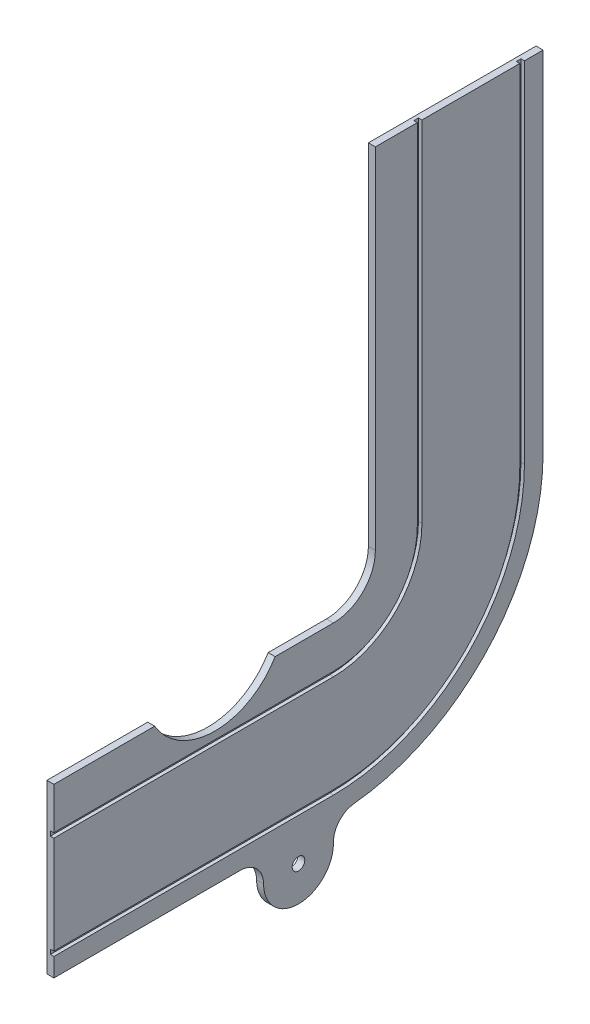
ISO-10303-21;
HEADER;
FILE_DESCRIPTION(('STEP AP214'),'2;1');
FILE_NAME('part.step','',(''),(''),'','','');
FILE_SCHEMA(('AUTOMOTIVE_DESIGN { 1 0 10303 214 1 1 1 1 }'));
ENDSEC;
DATA;
#1=APPLICATION_CONTEXT('core data for automotive mechanical design processes');
#2=APPLICATION_PROTOCOL_DEFINITION('international standard','automotive_design',2000,#1);
#3=PRODUCT_CONTEXT('',#1,'mechanical');
#4=PRODUCT('Part','Part','',(#3));
#5=PRODUCT_RELATED_PRODUCT_CATEGORY('part','',(#4));
#6=PRODUCT_DEFINITION_FORMATION('','',#4);
#7=PRODUCT_DEFINITION_CONTEXT('part definition',#1,'design');
#8=PRODUCT_DEFINITION('design','',#6,#7);
#9=PRODUCT_DEFINITION_SHAPE('','',#8);
#10=(LENGTH_UNIT() NAMED_UNIT(*) SI_UNIT(.MILLI.,.METRE.));
#11=(NAMED_UNIT(*) PLANE_ANGLE_UNIT() SI_UNIT($,.RADIAN.));
#12=(NAMED_UNIT(*) SI_UNIT($,.STERADIAN.) SOLID_ANGLE_UNIT());
#13=UNCERTAINTY_MEASURE_WITH_UNIT(LENGTH_MEASURE(1.E-05),#10,'distance_accuracy_value','');
#14=(GEOMETRIC_REPRESENTATION_CONTEXT(3) GLOBAL_UNCERTAINTY_ASSIGNED_CONTEXT((#13)) GLOBAL_UNIT_ASSIGNED_CONTEXT((#10,
#11,#12)) REPRESENTATION_CONTEXT('',''));
#15=CARTESIAN_POINT('',(0.,0.,0.));
#16=DIRECTION('',(0.,0.,1.));
#17=DIRECTION('',(1.,0.,0.));
#18=AXIS2_PLACEMENT_3D('',#15,#16,#17);
#19=CARTESIAN_POINT('',(3.,-18.,0.));
#20=DIRECTION('',(0.,-1.,0.));
#21=DIRECTION('',(0.,0.,-1.));
#22=AXIS2_PLACEMENT_3D('',#19,#20,#21);
#23=PLANE('',#22);
#24=DIRECTION('',(0.,0.,1.));
#25=VECTOR('',#24,1.);
#26=CARTESIAN_POINT('',(0.,-18.,0.));
#27=LINE('',#26,#25);
#28=CARTESIAN_POINT('',(0.,-18.,0.));
#29=VERTEX_POINT('',#28);
#30=CARTESIAN_POINT('',(0.,-18.,25.0330991311867));
#31=VERTEX_POINT('',#30);
#32=EDGE_CURVE('E248',#29,#31,#27,.T.);
#33=ORIENTED_EDGE('',*,*,#32,.T.);
#34=DIRECTION('',(1.,0.,0.));
#35=VECTOR('',#34,1.);
#36=CARTESIAN_POINT('',(0.,-18.,25.0330991311867));
#37=LINE('',#36,#35);
#38=CARTESIAN_POINT('',(3.,-18.,25.0330991311867));
#39=VERTEX_POINT('',#38);
#40=EDGE_CURVE('E49',#31,#39,#37,.T.);
#41=ORIENTED_EDGE('',*,*,#40,.T.);
#42=DIRECTION('',(0.,0.,1.));
#43=VECTOR('',#42,1.);
#44=CARTESIAN_POINT('',(3.,-18.,0.));
#45=LINE('',#44,#43);
#46=CARTESIAN_POINT('',(3.,-18.,0.));
#47=VERTEX_POINT('',#46);
#48=EDGE_CURVE('E446',#47,#39,#45,.T.);
#49=ORIENTED_EDGE('',*,*,#48,.F.);
#50=DIRECTION('',(-1.,0.,0.));
#51=VECTOR('',#50,1.);
#52=CARTESIAN_POINT('',(3.,-18.,0.));
#53=LINE('',#52,#51);
#54=EDGE_CURVE('E286',#47,#29,#53,.T.);
#55=ORIENTED_EDGE('',*,*,#54,.T.);
#56=EDGE_LOOP('',(#33,#41,#49,#55));
#57=FACE_BOUND('',#56,.T.);
#58=ADVANCED_FACE('F34',(#57),#23,.F.);
#59=CARTESIAN_POINT('',(3.,-90.,120.));
#60=DIRECTION('',(0.,1.,0.));
#61=DIRECTION('',(0.,0.,1.));
#62=AXIS2_PLACEMENT_3D('',#59,#60,#61);
#63=PLANE('',#62);
#64=DIRECTION('',(0.,0.,-1.));
#65=VECTOR('',#64,1.);
#66=CARTESIAN_POINT('',(0.,-90.,120.));
#67=LINE('',#66,#65);
#68=CARTESIAN_POINT('',(0.,-90.,120.));
#69=VERTEX_POINT('',#68);
#70=CARTESIAN_POINT('',(0.,-90.,40.));
#71=VERTEX_POINT('',#70);
#72=EDGE_CURVE('E257',#69,#71,#67,.T.);
#73=ORIENTED_EDGE('',*,*,#72,.T.);
#74=DIRECTION('',(1.,0.,0.));
#75=VECTOR('',#74,1.);
#76=CARTESIAN_POINT('',(3.,-90.,40.));
#77=LINE('',#76,#75);
#78=CARTESIAN_POINT('',(3.,-90.,40.));
#79=VERTEX_POINT('',#78);
#80=EDGE_CURVE('E294',#71,#79,#77,.T.);
#81=ORIENTED_EDGE('',*,*,#80,.T.);
#82=DIRECTION('',(0.,0.,-1.));
#83=VECTOR('',#82,1.);
#84=CARTESIAN_POINT('',(3.,-90.,120.));
#85=LINE('',#84,#83);
#86=CARTESIAN_POINT('',(3.,-90.,120.));
#87=VERTEX_POINT('',#86);
#88=EDGE_CURVE('E309',#87,#79,#85,.T.);
#89=ORIENTED_EDGE('',*,*,#88,.F.);
#90=DIRECTION('',(-1.,0.,0.));
#91=VECTOR('',#90,1.);
#92=CARTESIAN_POINT('',(3.,-90.,120.));
#93=LINE('',#92,#91);
#94=EDGE_CURVE('E281',#87,#69,#93,.T.);
#95=ORIENTED_EDGE('',*,*,#94,.T.);
#96=EDGE_LOOP('',(#73,#81,#89,#95));
#97=FACE_BOUND('',#96,.T.);
#98=ADVANCED_FACE('F575',(#97),#63,.F.);
#99=CARTESIAN_POINT('',(3.,0.,0.));
#100=DIRECTION('',(1.,0.,0.));
#101=DIRECTION('',(0.,0.,-1.));
#102=AXIS2_PLACEMENT_3D('',#99,#100,#101);
#103=PLANE('',#102);
#104=CARTESIAN_POINT('',(3.,-100.,15.));
#105=DIRECTION('',(1.,0.,0.));
#106=DIRECTION('',(0.,0.,-1.));
#107=AXIS2_PLACEMENT_3D('',#104,#105,#106);
#108=CIRCLE('',#107,2.7);
#109=CARTESIAN_POINT('',(3.,-100.,12.3));
#110=VERTEX_POINT('',#109);
#111=EDGE_CURVE('E482',#110,#110,#108,.T.);
#112=ORIENTED_EDGE('',*,*,#111,.F.);
#113=EDGE_LOOP('',(#112));
#114=FACE_BOUND('',#113,.T.);
#115=DIRECTION('',(0.,1.,0.));
#116=VECTOR('',#115,1.);
#117=CARTESIAN_POINT('',(3.,0.,-82.));
#118=LINE('',#117,#116);
#119=CARTESIAN_POINT('',(3.,0.,-82.));
#120=VERTEX_POINT('',#119);
#121=CARTESIAN_POINT('',(3.,150.,-82.));
#122=VERTEX_POINT('',#121);
#123=EDGE_CURVE('E365',#120,#122,#118,.T.);
#124=ORIENTED_EDGE('',*,*,#123,.F.);
#125=CARTESIAN_POINT('',(3.,0.,0.));
#126=DIRECTION('',(1.,0.,0.));
#127=DIRECTION('',(0.,0.,-1.));
#128=AXIS2_PLACEMENT_3D('',#125,#126,#127);
#129=CIRCLE('',#128,82.);
#130=CARTESIAN_POINT('',(3.,-82.,0.));
#131=VERTEX_POINT('',#130);
#132=EDGE_CURVE('E362',#131,#120,#129,.T.);
#133=ORIENTED_EDGE('',*,*,#132,.F.);
#134=DIRECTION('',(0.,0.,-1.));
#135=VECTOR('',#134,1.);
#136=CARTESIAN_POINT('',(3.,-82.,0.));
#137=LINE('',#136,#135);
#138=CARTESIAN_POINT('',(3.,-82.,120.));
#139=VERTEX_POINT('',#138);
#140=EDGE_CURVE('E359',#139,#131,#137,.T.);
#141=ORIENTED_EDGE('',*,*,#140,.F.);
#142=DIRECTION('',(0.,-1.,0.));
#143=VECTOR('',#142,1.);
#144=CARTESIAN_POINT('',(3.,-18.,120.));
#145=LINE('',#144,#143);
#146=EDGE_CURVE('E449',#139,#87,#145,.T.);
#147=ORIENTED_EDGE('',*,*,#146,.T.);
#148=ORIENTED_EDGE('',*,*,#88,.T.);
#149=CARTESIAN_POINT('',(3.,-100.,40.));
#150=DIRECTION('',(1.,0.,0.));
#151=DIRECTION('',(0.,0.,-1.));
#152=AXIS2_PLACEMENT_3D('',#149,#150,#151);
#153=CIRCLE('',#152,10.);
#154=CARTESIAN_POINT('',(3.,-100.,30.));
#155=VERTEX_POINT('',#154);
#156=EDGE_CURVE('E42',#79,#155,#153,.F.);
#157=ORIENTED_EDGE('',*,*,#156,.T.);
#158=CARTESIAN_POINT('',(3.,-100.,15.));
#159=DIRECTION('',(1.,0.,0.));
#160=DIRECTION('',(0.,0.,-1.));
#161=AXIS2_PLACEMENT_3D('',#158,#159,#160);
#162=CIRCLE('',#161,15.);
#163=CARTESIAN_POINT('',(3.,-100.,0.));
#164=VERTEX_POINT('',#163);
#165=EDGE_CURVE('E307',#155,#164,#162,.T.);
#166=ORIENTED_EDGE('',*,*,#165,.T.);
#167=DIRECTION('',(0.,1.,0.));
#168=VECTOR('',#167,1.);
#169=CARTESIAN_POINT('',(3.,0.,0.));
#170=LINE('',#169,#168);
#171=CARTESIAN_POINT('',(3.,-99.498743710662,0.));
#172=VERTEX_POINT('',#171);
#173=EDGE_CURVE('E319',#164,#172,#170,.T.);
#174=ORIENTED_EDGE('',*,*,#173,.T.);
#175=CARTESIAN_POINT('',(3.,-99.498743710662,-10.));
#176=DIRECTION('',(1.,0.,0.));
#177=DIRECTION('',(0.,0.,-1.));
#178=AXIS2_PLACEMENT_3D('',#175,#176,#177);
#179=CIRCLE('',#178,10.);
#180=CARTESIAN_POINT('',(3.,-89.5488693395958,-9.00000000000001));
#181=VERTEX_POINT('',#180);
#182=EDGE_CURVE('E299',#172,#181,#179,.F.);
#183=ORIENTED_EDGE('',*,*,#182,.T.);
#184=CARTESIAN_POINT('',(3.,0.,0.));
#185=DIRECTION('',(1.,0.,0.));
#186=DIRECTION('',(0.,0.,-1.));
#187=AXIS2_PLACEMENT_3D('',#184,#185,#186);
#188=CIRCLE('',#187,90.);
#189=CARTESIAN_POINT('',(3.,0.,-90.));
#190=VERTEX_POINT('',#189);
#191=EDGE_CURVE('E455',#181,#190,#188,.T.);
#192=ORIENTED_EDGE('',*,*,#191,.T.);
#193=DIRECTION('',(0.,1.,0.));
#194=VECTOR('',#193,1.);
#195=CARTESIAN_POINT('',(3.,150.,-90.));
#196=LINE('',#195,#194);
#197=CARTESIAN_POINT('',(3.,150.,-90.));
#198=VERTEX_POINT('',#197);
#199=EDGE_CURVE('E457',#190,#198,#196,.T.);
#200=ORIENTED_EDGE('',*,*,#199,.T.);
#201=DIRECTION('',(0.,0.,1.));
#202=VECTOR('',#201,1.);
#203=CARTESIAN_POINT('',(3.,150.,-18.));
#204=LINE('',#203,#202);
#205=EDGE_CURVE('E460',#198,#122,#204,.T.);
#206=ORIENTED_EDGE('',*,*,#205,.T.);
#207=EDGE_LOOP('',(#124,#133,#141,#147,#148,#157,#166,#174,#183,#192,#200,#206));
#208=FACE_BOUND('',#207,.T.);
#209=ADVANCED_FACE('F305',(#114,#208),#103,.T.);
#210=CARTESIAN_POINT('',(3.,-2.77203653632514,50.8809061706433));
#211=DIRECTION('',(1.,0.,0.));
#212=DIRECTION('',(0.,0.,-1.));
#213=AXIS2_PLACEMENT_3D('',#210,#211,#212);
#214=CIRCLE('',#213,30.);
#215=CARTESIAN_POINT('',(3.,-18.,76.7287132101));
#216=VERTEX_POINT('',#215);
#217=EDGE_CURVE('E235',#216,#39,#214,.T.);
#218=ORIENTED_EDGE('',*,*,#217,.F.);
#219=CARTESIAN_POINT('',(3.,-18.,120.));
#220=VERTEX_POINT('',#219);
#221=EDGE_CURVE('E243',#216,#220,#45,.T.);
#222=ORIENTED_EDGE('',*,*,#221,.T.);
#223=CARTESIAN_POINT('',(3.,-36.,120.));
#224=VERTEX_POINT('',#223);
#225=EDGE_CURVE('E450',#220,#224,#145,.T.);
#226=ORIENTED_EDGE('',*,*,#225,.T.);
#227=DIRECTION('',(0.,0.,1.));
#228=VECTOR('',#227,1.);
#229=CARTESIAN_POINT('',(3.,-36.,0.));
#230=LINE('',#229,#228);
#231=CARTESIAN_POINT('',(3.,-36.,0.));
#232=VERTEX_POINT('',#231);
#233=EDGE_CURVE('E423',#232,#224,#230,.T.);
#234=ORIENTED_EDGE('',*,*,#233,.F.);
#235=CARTESIAN_POINT('',(3.,0.,0.));
#236=DIRECTION('',(-1.,0.,0.));
#237=DIRECTION('',(0.,0.,-1.));
#238=AXIS2_PLACEMENT_3D('',#235,#236,#237);
#239=CIRCLE('',#238,36.);
#240=CARTESIAN_POINT('',(3.,0.,-36.));
#241=VERTEX_POINT('',#240);
#242=EDGE_CURVE('E420',#241,#232,#239,.T.);
#243=ORIENTED_EDGE('',*,*,#242,.F.);
#244=DIRECTION('',(0.,-1.,0.));
#245=VECTOR('',#244,1.);
#246=CARTESIAN_POINT('',(3.,0.,-36.));
#247=LINE('',#246,#245);
#248=CARTESIAN_POINT('',(3.,150.,-36.));
#249=VERTEX_POINT('',#248);
#250=EDGE_CURVE('E417',#249,#241,#247,.T.);
#251=ORIENTED_EDGE('',*,*,#250,.F.);
#252=CARTESIAN_POINT('',(3.,150.,-18.));
#253=VERTEX_POINT('',#252);
#254=EDGE_CURVE('E459',#249,#253,#204,.T.);
#255=ORIENTED_EDGE('',*,*,#254,.T.);
#256=DIRECTION('',(0.,-1.,0.));
#257=VECTOR('',#256,1.);
#258=CARTESIAN_POINT('',(3.,0.,-18.));
#259=LINE('',#258,#257);
#260=CARTESIAN_POINT('',(3.,0.,-18.));
#261=VERTEX_POINT('',#260);
#262=EDGE_CURVE('E272',#253,#261,#259,.T.);
#263=ORIENTED_EDGE('',*,*,#262,.T.);
#264=CARTESIAN_POINT('',(3.,0.,0.));
#265=DIRECTION('',(-1.,0.,0.));
#266=DIRECTION('',(0.,0.,-1.));
#267=AXIS2_PLACEMENT_3D('',#264,#265,#266);
#268=CIRCLE('',#267,18.);
#269=EDGE_CURVE('E267',#261,#47,#268,.T.);
#270=ORIENTED_EDGE('',*,*,#269,.T.);
#271=ORIENTED_EDGE('',*,*,#48,.T.);
#272=EDGE_LOOP('',(#218,#222,#226,#234,#243,#251,#255,#263,#270,#271));
#273=FACE_BOUND('',#272,.T.);
#274=ADVANCED_FACE('F466',(#273),#103,.T.);
#275=CARTESIAN_POINT('',(3.,0.,0.));
#276=DIRECTION('',(-1.,0.,0.));
#277=DIRECTION('',(0.,0.,1.));
#278=AXIS2_PLACEMENT_3D('',#275,#276,#277);
#279=CYLINDRICAL_SURFACE('',#278,18.);
#280=CARTESIAN_POINT('',(0.,0.,0.));
#281=DIRECTION('',(-1.,0.,0.));
#282=DIRECTION('',(0.,0.,-1.));
#283=AXIS2_PLACEMENT_3D('',#280,#281,#282);
#284=CIRCLE('',#283,18.);
#285=CARTESIAN_POINT('',(0.,0.,-18.));
#286=VERTEX_POINT('',#285);
#287=EDGE_CURVE('E249',#286,#29,#284,.T.);
#288=ORIENTED_EDGE('',*,*,#287,.T.);
#289=ORIENTED_EDGE('',*,*,#54,.F.);
#290=ORIENTED_EDGE('',*,*,#269,.F.);
#291=DIRECTION('',(-1.,0.,0.));
#292=VECTOR('',#291,1.);
#293=CARTESIAN_POINT('',(3.,0.,-18.));
#294=LINE('',#293,#292);
#295=EDGE_CURVE('E268',#261,#286,#294,.T.);
#296=ORIENTED_EDGE('',*,*,#295,.T.);
#297=EDGE_LOOP('',(#288,#289,#290,#296));
#298=FACE_BOUND('',#297,.T.);
#299=ADVANCED_FACE('F477',(#298),#279,.F.);
#300=ORIENTED_EDGE('',*,*,#221,.F.);
#301=DIRECTION('',(1.,0.,0.));
#302=VECTOR('',#301,1.);
#303=CARTESIAN_POINT('',(0.,-18.,76.7287132101));
#304=LINE('',#303,#302);
#305=CARTESIAN_POINT('',(0.,-18.,76.7287132101));
#306=VERTEX_POINT('',#305);
#307=EDGE_CURVE('E231',#216,#306,#304,.F.);
#308=ORIENTED_EDGE('',*,*,#307,.T.);
#309=CARTESIAN_POINT('',(0.,-18.,120.));
#310=VERTEX_POINT('',#309);
#311=EDGE_CURVE('E241',#306,#310,#27,.T.);
#312=ORIENTED_EDGE('',*,*,#311,.T.);
#313=DIRECTION('',(-1.,0.,0.));
#314=VECTOR('',#313,1.);
#315=CARTESIAN_POINT('',(3.,-18.,120.));
#316=LINE('',#315,#314);
#317=EDGE_CURVE('E284',#220,#310,#316,.T.);
#318=ORIENTED_EDGE('',*,*,#317,.F.);
#319=EDGE_LOOP('',(#300,#308,#312,#318));
#320=FACE_BOUND('',#319,.T.);
#321=ADVANCED_FACE('F239',(#320),#23,.F.);
#322=CARTESIAN_POINT('',(3.,-18.,120.));
#323=DIRECTION('',(0.,0.,-1.));
#324=DIRECTION('',(0.,1.,0.));
#325=AXIS2_PLACEMENT_3D('',#322,#323,#324);
#326=PLANE('',#325);
#327=ORIENTED_EDGE('',*,*,#146,.F.);
#328=DIRECTION('',(1.,0.,0.));
#329=VECTOR('',#328,1.);
#330=CARTESIAN_POINT('',(1.5,-82.,120.));
#331=LINE('',#330,#329);
#332=CARTESIAN_POINT('',(1.5,-82.,120.));
#333=VERTEX_POINT('',#332);
#334=EDGE_CURVE('E381',#333,#139,#331,.T.);
#335=ORIENTED_EDGE('',*,*,#334,.F.);
#336=DIRECTION('',(0.,-1.,0.));
#337=VECTOR('',#336,1.);
#338=CARTESIAN_POINT('',(1.5,-80.,120.));
#339=LINE('',#338,#337);
#340=CARTESIAN_POINT('',(1.5,-80.,120.));
#341=VERTEX_POINT('',#340);
#342=EDGE_CURVE('E338',#341,#333,#339,.T.);
#343=ORIENTED_EDGE('',*,*,#342,.F.);
#344=DIRECTION('',(1.,0.,0.));
#345=VECTOR('',#344,1.);
#346=CARTESIAN_POINT('',(1.5,-80.,120.));
#347=LINE('',#346,#345);
#348=CARTESIAN_POINT('',(3.,-80.,120.));
#349=VERTEX_POINT('',#348);
#350=EDGE_CURVE('E383',#341,#349,#347,.T.);
#351=ORIENTED_EDGE('',*,*,#350,.T.);
#352=CARTESIAN_POINT('',(3.,-38.,120.));
#353=VERTEX_POINT('',#352);
#354=EDGE_CURVE('E453',#353,#349,#145,.T.);
#355=ORIENTED_EDGE('',*,*,#354,.F.);
#356=DIRECTION('',(1.,0.,0.));
#357=VECTOR('',#356,1.);
#358=CARTESIAN_POINT('',(1.5,-38.,120.));
#359=LINE('',#358,#357);
#360=CARTESIAN_POINT('',(1.5,-38.,120.));
#361=VERTEX_POINT('',#360);
#362=EDGE_CURVE('E428',#361,#353,#359,.T.);
#363=ORIENTED_EDGE('',*,*,#362,.F.);
#364=DIRECTION('',(0.,-1.,0.));
#365=VECTOR('',#364,1.);
#366=CARTESIAN_POINT('',(1.5,-36.,120.));
#367=LINE('',#366,#365);
#368=CARTESIAN_POINT('',(1.5,-36.,120.));
#369=VERTEX_POINT('',#368);
#370=EDGE_CURVE('E407',#369,#361,#367,.T.);
#371=ORIENTED_EDGE('',*,*,#370,.F.);
#372=DIRECTION('',(1.,0.,0.));
#373=VECTOR('',#372,1.);
#374=CARTESIAN_POINT('',(1.5,-36.,120.));
#375=LINE('',#374,#373);
#376=EDGE_CURVE('E430',#369,#224,#375,.T.);
#377=ORIENTED_EDGE('',*,*,#376,.T.);
#378=ORIENTED_EDGE('',*,*,#225,.F.);
#379=ORIENTED_EDGE('',*,*,#317,.T.);
#380=DIRECTION('',(0.,-1.,0.));
#381=VECTOR('',#380,1.);
#382=CARTESIAN_POINT('',(0.,-18.,120.));
#383=LINE('',#382,#381);
#384=EDGE_CURVE('E247',#310,#69,#383,.T.);
#385=ORIENTED_EDGE('',*,*,#384,.T.);
#386=ORIENTED_EDGE('',*,*,#94,.F.);
#387=EDGE_LOOP('',(#327,#335,#343,#351,#355,#363,#371,#377,#378,#379,#385,#386));
#388=FACE_BOUND('',#387,.T.);
#389=ADVANCED_FACE('F524',(#388),#326,.F.);
#390=CARTESIAN_POINT('',(3.,0.,0.));
#391=DIRECTION('',(-1.,0.,0.));
#392=DIRECTION('',(0.,0.,1.));
#393=AXIS2_PLACEMENT_3D('',#390,#391,#392);
#394=CYLINDRICAL_SURFACE('',#393,90.);
#395=ORIENTED_EDGE('',*,*,#191,.F.);
#396=DIRECTION('',(-1.,0.,0.));
#397=VECTOR('',#396,1.);
#398=CARTESIAN_POINT('',(3.,-89.5488693395958,-9.00000000000001));
#399=LINE('',#398,#397);
#400=CARTESIAN_POINT('',(0.,-89.5488693395958,-9.00000000000001));
#401=VERTEX_POINT('',#400);
#402=EDGE_CURVE('E289',#181,#401,#399,.T.);
#403=ORIENTED_EDGE('',*,*,#402,.T.);
#404=CARTESIAN_POINT('',(0.,0.,0.));
#405=DIRECTION('',(1.,0.,0.));
#406=DIRECTION('',(0.,0.,-1.));
#407=AXIS2_PLACEMENT_3D('',#404,#405,#406);
#408=CIRCLE('',#407,90.);
#409=CARTESIAN_POINT('',(0.,0.,-90.));
#410=VERTEX_POINT('',#409);
#411=EDGE_CURVE('E259',#401,#410,#408,.T.);
#412=ORIENTED_EDGE('',*,*,#411,.T.);
#413=DIRECTION('',(-1.,0.,0.));
#414=VECTOR('',#413,1.);
#415=CARTESIAN_POINT('',(3.,0.,-90.));
#416=LINE('',#415,#414);
#417=EDGE_CURVE('E278',#190,#410,#416,.T.);
#418=ORIENTED_EDGE('',*,*,#417,.F.);
#419=EDGE_LOOP('',(#395,#403,#412,#418));
#420=FACE_BOUND('',#419,.T.);
#421=ADVANCED_FACE('F496',(#420),#394,.T.);
#422=CARTESIAN_POINT('',(3.,150.,-90.));
#423=DIRECTION('',(0.,0.,1.));
#424=DIRECTION('',(0.,-1.,0.));
#425=AXIS2_PLACEMENT_3D('',#422,#423,#424);
#426=PLANE('',#425);
#427=DIRECTION('',(0.,1.,0.));
#428=VECTOR('',#427,1.);
#429=CARTESIAN_POINT('',(0.,150.,-90.));
#430=LINE('',#429,#428);
#431=CARTESIAN_POINT('',(0.,150.,-90.));
#432=VERTEX_POINT('',#431);
#433=EDGE_CURVE('E261',#410,#432,#430,.T.);
#434=ORIENTED_EDGE('',*,*,#433,.T.);
#435=DIRECTION('',(-1.,0.,0.));
#436=VECTOR('',#435,1.);
#437=CARTESIAN_POINT('',(3.,150.,-90.));
#438=LINE('',#437,#436);
#439=EDGE_CURVE('E275',#198,#432,#438,.T.);
#440=ORIENTED_EDGE('',*,*,#439,.F.);
#441=ORIENTED_EDGE('',*,*,#199,.F.);
#442=ORIENTED_EDGE('',*,*,#417,.T.);
#443=EDGE_LOOP('',(#434,#440,#441,#442));
#444=FACE_BOUND('',#443,.T.);
#445=ADVANCED_FACE('F503',(#444),#426,.F.);
#446=CARTESIAN_POINT('',(3.,150.,-18.));
#447=DIRECTION('',(0.,-1.,0.));
#448=DIRECTION('',(0.,0.,-1.));
#449=AXIS2_PLACEMENT_3D('',#446,#447,#448);
#450=PLANE('',#449);
#451=CARTESIAN_POINT('',(3.,150.,-80.));
#452=VERTEX_POINT('',#451);
#453=CARTESIAN_POINT('',(3.,150.,-38.));
#454=VERTEX_POINT('',#453);
#455=EDGE_CURVE('E462',#452,#454,#204,.T.);
#456=ORIENTED_EDGE('',*,*,#455,.F.);
#457=DIRECTION('',(1.,0.,0.));
#458=VECTOR('',#457,1.);
#459=CARTESIAN_POINT('',(1.5,150.,-80.));
#460=LINE('',#459,#458);
#461=CARTESIAN_POINT('',(1.5,150.,-80.));
#462=VERTEX_POINT('',#461);
#463=EDGE_CURVE('E372',#462,#452,#460,.T.);
#464=ORIENTED_EDGE('',*,*,#463,.F.);
#465=DIRECTION('',(0.,0.,1.));
#466=VECTOR('',#465,1.);
#467=CARTESIAN_POINT('',(1.5,150.,-80.));
#468=LINE('',#467,#466);
#469=CARTESIAN_POINT('',(1.5,150.,-82.));
#470=VERTEX_POINT('',#469);
#471=EDGE_CURVE('E350',#470,#462,#468,.T.);
#472=ORIENTED_EDGE('',*,*,#471,.F.);
#473=DIRECTION('',(1.,0.,0.));
#474=VECTOR('',#473,1.);
#475=CARTESIAN_POINT('',(1.5,150.,-82.));
#476=LINE('',#475,#474);
#477=EDGE_CURVE('E374',#470,#122,#476,.T.);
#478=ORIENTED_EDGE('',*,*,#477,.T.);
#479=ORIENTED_EDGE('',*,*,#205,.F.);
#480=ORIENTED_EDGE('',*,*,#439,.T.);
#481=DIRECTION('',(0.,0.,1.));
#482=VECTOR('',#481,1.);
#483=CARTESIAN_POINT('',(0.,150.,-18.));
#484=LINE('',#483,#482);
#485=CARTESIAN_POINT('',(0.,150.,-18.));
#486=VERTEX_POINT('',#485);
#487=EDGE_CURVE('E263',#432,#486,#484,.T.);
#488=ORIENTED_EDGE('',*,*,#487,.T.);
#489=DIRECTION('',(-1.,0.,0.));
#490=VECTOR('',#489,1.);
#491=CARTESIAN_POINT('',(3.,150.,-18.));
#492=LINE('',#491,#490);
#493=EDGE_CURVE('E271',#253,#486,#492,.T.);
#494=ORIENTED_EDGE('',*,*,#493,.F.);
#495=ORIENTED_EDGE('',*,*,#254,.F.);
#496=DIRECTION('',(1.,0.,0.));
#497=VECTOR('',#496,1.);
#498=CARTESIAN_POINT('',(1.5,150.,-36.));
#499=LINE('',#498,#497);
#500=CARTESIAN_POINT('',(1.5,150.,-36.));
#501=VERTEX_POINT('',#500);
#502=EDGE_CURVE('E437',#501,#249,#499,.T.);
#503=ORIENTED_EDGE('',*,*,#502,.F.);
#504=DIRECTION('',(0.,0.,1.));
#505=VECTOR('',#504,1.);
#506=CARTESIAN_POINT('',(1.5,150.,-36.));
#507=LINE('',#506,#505);
#508=CARTESIAN_POINT('',(1.5,150.,-38.));
#509=VERTEX_POINT('',#508);
#510=EDGE_CURVE('E395',#509,#501,#507,.T.);
#511=ORIENTED_EDGE('',*,*,#510,.F.);
#512=DIRECTION('',(1.,0.,0.));
#513=VECTOR('',#512,1.);
#514=CARTESIAN_POINT('',(1.5,150.,-38.));
#515=LINE('',#514,#513);
#516=EDGE_CURVE('E439',#509,#454,#515,.T.);
#517=ORIENTED_EDGE('',*,*,#516,.T.);
#518=EDGE_LOOP('',(#456,#464,#472,#478,#479,#480,#488,#494,#495,#503,#511,#517));
#519=FACE_BOUND('',#518,.T.);
#520=ADVANCED_FACE('F508',(#519),#450,.F.);
#521=CARTESIAN_POINT('',(3.,0.,-18.));
#522=DIRECTION('',(0.,0.,-1.));
#523=DIRECTION('',(-1.,0.,0.));
#524=AXIS2_PLACEMENT_3D('',#521,#522,#523);
#525=PLANE('',#524);
#526=DIRECTION('',(0.,-1.,0.));
#527=VECTOR('',#526,1.);
#528=CARTESIAN_POINT('',(0.,0.,-18.));
#529=LINE('',#528,#527);
#530=EDGE_CURVE('E265',#486,#286,#529,.T.);
#531=ORIENTED_EDGE('',*,*,#530,.T.);
#532=ORIENTED_EDGE('',*,*,#295,.F.);
#533=ORIENTED_EDGE('',*,*,#262,.F.);
#534=ORIENTED_EDGE('',*,*,#493,.T.);
#535=EDGE_LOOP('',(#531,#532,#533,#534));
#536=FACE_BOUND('',#535,.T.);
#537=ADVANCED_FACE('F473',(#536),#525,.F.);
#538=DIRECTION('',(0.,-1.,0.));
#539=VECTOR('',#538,1.);
#540=CARTESIAN_POINT('',(3.,0.,-80.));
#541=LINE('',#540,#539);
#542=CARTESIAN_POINT('',(3.,0.,-80.));
#543=VERTEX_POINT('',#542);
#544=EDGE_CURVE('E335',#452,#543,#541,.T.);
#545=ORIENTED_EDGE('',*,*,#544,.F.);
#546=ORIENTED_EDGE('',*,*,#455,.T.);
#547=DIRECTION('',(0.,1.,0.));
#548=VECTOR('',#547,1.);
#549=CARTESIAN_POINT('',(3.,0.,-38.));
#550=LINE('',#549,#548);
#551=CARTESIAN_POINT('',(3.,0.,-38.));
#552=VERTEX_POINT('',#551);
#553=EDGE_CURVE('E414',#552,#454,#550,.T.);
#554=ORIENTED_EDGE('',*,*,#553,.F.);
#555=CARTESIAN_POINT('',(3.,0.,0.));
#556=DIRECTION('',(1.,0.,0.));
#557=DIRECTION('',(0.,0.,-1.));
#558=AXIS2_PLACEMENT_3D('',#555,#556,#557);
#559=CIRCLE('',#558,38.);
#560=CARTESIAN_POINT('',(3.,-38.,0.));
#561=VERTEX_POINT('',#560);
#562=EDGE_CURVE('E371',#561,#552,#559,.T.);
#563=ORIENTED_EDGE('',*,*,#562,.F.);
#564=DIRECTION('',(0.,0.,-1.));
#565=VECTOR('',#564,1.);
#566=CARTESIAN_POINT('',(3.,-38.,0.));
#567=LINE('',#566,#565);
#568=EDGE_CURVE('E392',#353,#561,#567,.T.);
#569=ORIENTED_EDGE('',*,*,#568,.F.);
#570=ORIENTED_EDGE('',*,*,#354,.T.);
#571=DIRECTION('',(0.,0.,1.));
#572=VECTOR('',#571,1.);
#573=CARTESIAN_POINT('',(3.,-80.,0.));
#574=LINE('',#573,#572);
#575=CARTESIAN_POINT('',(3.,-80.,0.));
#576=VERTEX_POINT('',#575);
#577=EDGE_CURVE('E357',#576,#349,#574,.T.);
#578=ORIENTED_EDGE('',*,*,#577,.F.);
#579=CARTESIAN_POINT('',(3.,0.,0.));
#580=DIRECTION('',(-1.,0.,0.));
#581=DIRECTION('',(0.,0.,-1.));
#582=AXIS2_PLACEMENT_3D('',#579,#580,#581);
#583=CIRCLE('',#582,80.);
#584=EDGE_CURVE('E324',#543,#576,#583,.T.);
#585=ORIENTED_EDGE('',*,*,#584,.F.);
#586=EDGE_LOOP('',(#545,#546,#554,#563,#569,#570,#578,#585));
#587=FACE_BOUND('',#586,.T.);
#588=ADVANCED_FACE('F532',(#587),#103,.T.);
#589=CARTESIAN_POINT('',(0.,0.,0.));
#590=DIRECTION('',(1.,0.,0.));
#591=DIRECTION('',(0.,0.,-1.));
#592=AXIS2_PLACEMENT_3D('',#589,#590,#591);
#593=PLANE('',#592);
#594=CARTESIAN_POINT('',(0.,-100.,15.));
#595=DIRECTION('',(1.,0.,0.));
#596=DIRECTION('',(0.,0.,-1.));
#597=AXIS2_PLACEMENT_3D('',#594,#595,#596);
#598=CIRCLE('',#597,2.7);
#599=CARTESIAN_POINT('',(0.,-100.,12.3));
#600=VERTEX_POINT('',#599);
#601=EDGE_CURVE('E320',#600,#600,#598,.T.);
#602=ORIENTED_EDGE('',*,*,#601,.T.);
#603=EDGE_LOOP('',(#602));
#604=FACE_BOUND('',#603,.T.);
#605=ORIENTED_EDGE('',*,*,#311,.F.);
#606=CARTESIAN_POINT('',(0.,-2.77203653632514,50.8809061706433));
#607=DIRECTION('',(1.,0.,0.));
#608=DIRECTION('',(0.,0.,-1.));
#609=AXIS2_PLACEMENT_3D('',#606,#607,#608);
#610=CIRCLE('',#609,30.);
#611=EDGE_CURVE('E228',#306,#31,#610,.T.);
#612=ORIENTED_EDGE('',*,*,#611,.T.);
#613=ORIENTED_EDGE('',*,*,#32,.F.);
#614=ORIENTED_EDGE('',*,*,#287,.F.);
#615=ORIENTED_EDGE('',*,*,#530,.F.);
#616=ORIENTED_EDGE('',*,*,#487,.F.);
#617=ORIENTED_EDGE('',*,*,#433,.F.);
#618=ORIENTED_EDGE('',*,*,#411,.F.);
#619=CARTESIAN_POINT('',(0.,-99.498743710662,-10.));
#620=DIRECTION('',(1.,0.,0.));
#621=DIRECTION('',(0.,0.,-1.));
#622=AXIS2_PLACEMENT_3D('',#619,#620,#621);
#623=CIRCLE('',#622,10.);
#624=CARTESIAN_POINT('',(0.,-99.498743710662,0.));
#625=VERTEX_POINT('',#624);
#626=EDGE_CURVE('E297',#401,#625,#623,.T.);
#627=ORIENTED_EDGE('',*,*,#626,.T.);
#628=DIRECTION('',(0.,1.,0.));
#629=VECTOR('',#628,1.);
#630=CARTESIAN_POINT('',(0.,0.,0.));
#631=LINE('',#630,#629);
#632=CARTESIAN_POINT('',(0.,-100.,0.));
#633=VERTEX_POINT('',#632);
#634=EDGE_CURVE('E322',#633,#625,#631,.T.);
#635=ORIENTED_EDGE('',*,*,#634,.F.);
#636=CARTESIAN_POINT('',(0.,-100.,15.));
#637=DIRECTION('',(1.,0.,0.));
#638=DIRECTION('',(0.,0.,-1.));
#639=AXIS2_PLACEMENT_3D('',#636,#637,#638);
#640=CIRCLE('',#639,15.);
#641=CARTESIAN_POINT('',(0.,-100.,30.));
#642=VERTEX_POINT('',#641);
#643=EDGE_CURVE('E327',#642,#633,#640,.T.);
#644=ORIENTED_EDGE('',*,*,#643,.F.);
#645=CARTESIAN_POINT('',(0.,-100.,40.));
#646=DIRECTION('',(1.,0.,0.));
#647=DIRECTION('',(0.,0.,-1.));
#648=AXIS2_PLACEMENT_3D('',#645,#646,#647);
#649=CIRCLE('',#648,10.);
#650=EDGE_CURVE('E11',#642,#71,#649,.T.);
#651=ORIENTED_EDGE('',*,*,#650,.T.);
#652=ORIENTED_EDGE('',*,*,#72,.F.);
#653=ORIENTED_EDGE('',*,*,#384,.F.);
#654=EDGE_LOOP('',(#605,#612,#613,#614,#615,#616,#617,#618,#627,#635,#644,#651,#652,#653));
#655=FACE_BOUND('',#654,.T.);
#656=ADVANCED_FACE('F246',(#604,#655),#593,.F.);
#657=CARTESIAN_POINT('',(1.5,0.,0.));
#658=DIRECTION('',(1.,0.,0.));
#659=DIRECTION('',(0.,0.,-1.));
#660=AXIS2_PLACEMENT_3D('',#657,#658,#659);
#661=CYLINDRICAL_SURFACE('',#660,38.);
#662=ORIENTED_EDGE('',*,*,#562,.T.);
#663=DIRECTION('',(1.,0.,0.));
#664=VECTOR('',#663,1.);
#665=CARTESIAN_POINT('',(1.5,0.,-38.));
#666=LINE('',#665,#664);
#667=CARTESIAN_POINT('',(1.5,0.,-38.));
#668=VERTEX_POINT('',#667);
#669=EDGE_CURVE('E412',#668,#552,#666,.T.);
#670=ORIENTED_EDGE('',*,*,#669,.F.);
#671=CARTESIAN_POINT('',(1.5,0.,0.));
#672=DIRECTION('',(1.,0.,0.));
#673=DIRECTION('',(0.,0.,-1.));
#674=AXIS2_PLACEMENT_3D('',#671,#672,#673);
#675=CIRCLE('',#674,38.);
#676=CARTESIAN_POINT('',(1.5,-38.,0.));
#677=VERTEX_POINT('',#676);
#678=EDGE_CURVE('E388',#677,#668,#675,.T.);
#679=ORIENTED_EDGE('',*,*,#678,.F.);
#680=DIRECTION('',(1.,0.,0.));
#681=VECTOR('',#680,1.);
#682=CARTESIAN_POINT('',(1.5,-38.,0.));
#683=LINE('',#682,#681);
#684=EDGE_CURVE('E252',#677,#561,#683,.T.);
#685=ORIENTED_EDGE('',*,*,#684,.T.);
#686=EDGE_LOOP('',(#662,#670,#679,#685));
#687=FACE_BOUND('',#686,.T.);
#688=ADVANCED_FACE('F559',(#687),#661,.F.);
#689=CARTESIAN_POINT('',(1.5,-38.,0.));
#690=DIRECTION('',(0.,-1.,0.));
#691=DIRECTION('',(0.,0.,-1.));
#692=AXIS2_PLACEMENT_3D('',#689,#690,#691);
#693=PLANE('',#692);
#694=ORIENTED_EDGE('',*,*,#568,.T.);
#695=ORIENTED_EDGE('',*,*,#684,.F.);
#696=DIRECTION('',(0.,0.,-1.));
#697=VECTOR('',#696,1.);
#698=CARTESIAN_POINT('',(1.5,-38.,0.));
#699=LINE('',#698,#697);
#700=EDGE_CURVE('E409',#361,#677,#699,.T.);
#701=ORIENTED_EDGE('',*,*,#700,.F.);
#702=ORIENTED_EDGE('',*,*,#362,.T.);
#703=EDGE_LOOP('',(#694,#695,#701,#702));
#704=FACE_BOUND('',#703,.T.);
#705=ADVANCED_FACE('F561',(#704),#693,.F.);
#706=CARTESIAN_POINT('',(1.5,-36.,0.));
#707=DIRECTION('',(0.,1.,0.));
#708=DIRECTION('',(0.,0.,1.));
#709=AXIS2_PLACEMENT_3D('',#706,#707,#708);
#710=PLANE('',#709);
#711=ORIENTED_EDGE('',*,*,#233,.T.);
#712=ORIENTED_EDGE('',*,*,#376,.F.);
#713=DIRECTION('',(0.,0.,1.));
#714=VECTOR('',#713,1.);
#715=CARTESIAN_POINT('',(1.5,-36.,0.));
#716=LINE('',#715,#714);
#717=CARTESIAN_POINT('',(1.5,-36.,0.));
#718=VERTEX_POINT('',#717);
#719=EDGE_CURVE('E404',#718,#369,#716,.T.);
#720=ORIENTED_EDGE('',*,*,#719,.F.);
#721=DIRECTION('',(1.,0.,0.));
#722=VECTOR('',#721,1.);
#723=CARTESIAN_POINT('',(1.5,-36.,0.));
#724=LINE('',#723,#722);
#725=EDGE_CURVE('E433',#718,#232,#724,.T.);
#726=ORIENTED_EDGE('',*,*,#725,.T.);
#727=EDGE_LOOP('',(#711,#712,#720,#726));
#728=FACE_BOUND('',#727,.T.);
#729=ADVANCED_FACE('F563',(#728),#710,.F.);
#730=CARTESIAN_POINT('',(1.5,0.,0.));
#731=DIRECTION('',(1.,0.,0.));
#732=DIRECTION('',(0.,0.,-1.));
#733=AXIS2_PLACEMENT_3D('',#730,#731,#732);
#734=CYLINDRICAL_SURFACE('',#733,36.);
#735=ORIENTED_EDGE('',*,*,#242,.T.);
#736=ORIENTED_EDGE('',*,*,#725,.F.);
#737=CARTESIAN_POINT('',(1.5,0.,0.));
#738=DIRECTION('',(-1.,0.,0.));
#739=DIRECTION('',(0.,0.,-1.));
#740=AXIS2_PLACEMENT_3D('',#737,#738,#739);
#741=CIRCLE('',#740,36.);
#742=CARTESIAN_POINT('',(1.5,0.,-36.));
#743=VERTEX_POINT('',#742);
#744=EDGE_CURVE('E401',#743,#718,#741,.T.);
#745=ORIENTED_EDGE('',*,*,#744,.F.);
#746=DIRECTION('',(1.,0.,0.));
#747=VECTOR('',#746,1.);
#748=CARTESIAN_POINT('',(1.5,0.,-36.));
#749=LINE('',#748,#747);
#750=EDGE_CURVE('E435',#743,#241,#749,.T.);
#751=ORIENTED_EDGE('',*,*,#750,.T.);
#752=EDGE_LOOP('',(#735,#736,#745,#751));
#753=FACE_BOUND('',#752,.T.);
#754=ADVANCED_FACE('F569',(#753),#734,.T.);
#755=CARTESIAN_POINT('',(1.5,0.,-36.));
#756=DIRECTION('',(0.,0.,1.));
#757=DIRECTION('',(1.,0.,0.));
#758=AXIS2_PLACEMENT_3D('',#755,#756,#757);
#759=PLANE('',#758);
#760=ORIENTED_EDGE('',*,*,#250,.T.);
#761=ORIENTED_EDGE('',*,*,#750,.F.);
#762=DIRECTION('',(0.,-1.,0.));
#763=VECTOR('',#762,1.);
#764=CARTESIAN_POINT('',(1.5,0.,-36.));
#765=LINE('',#764,#763);
#766=EDGE_CURVE('E398',#501,#743,#765,.T.);
#767=ORIENTED_EDGE('',*,*,#766,.F.);
#768=ORIENTED_EDGE('',*,*,#502,.T.);
#769=EDGE_LOOP('',(#760,#761,#767,#768));
#770=FACE_BOUND('',#769,.T.);
#771=ADVANCED_FACE('F625',(#770),#759,.F.);
#772=CARTESIAN_POINT('',(1.5,0.,-38.));
#773=DIRECTION('',(0.,0.,-1.));
#774=DIRECTION('',(-1.,0.,0.));
#775=AXIS2_PLACEMENT_3D('',#772,#773,#774);
#776=PLANE('',#775);
#777=ORIENTED_EDGE('',*,*,#553,.T.);
#778=ORIENTED_EDGE('',*,*,#516,.F.);
#779=DIRECTION('',(0.,1.,0.));
#780=VECTOR('',#779,1.);
#781=CARTESIAN_POINT('',(1.5,0.,-38.));
#782=LINE('',#781,#780);
#783=EDGE_CURVE('E391',#668,#509,#782,.T.);
#784=ORIENTED_EDGE('',*,*,#783,.F.);
#785=ORIENTED_EDGE('',*,*,#669,.T.);
#786=EDGE_LOOP('',(#777,#778,#784,#785));
#787=FACE_BOUND('',#786,.T.);
#788=ADVANCED_FACE('F553',(#787),#776,.F.);
#789=CARTESIAN_POINT('',(1.5,0.,0.));
#790=DIRECTION('',(1.,0.,0.));
#791=DIRECTION('',(0.,0.,-1.));
#792=AXIS2_PLACEMENT_3D('',#789,#790,#791);
#793=PLANE('',#792);
#794=ORIENTED_EDGE('',*,*,#678,.T.);
#795=ORIENTED_EDGE('',*,*,#783,.T.);
#796=ORIENTED_EDGE('',*,*,#510,.T.);
#797=ORIENTED_EDGE('',*,*,#766,.T.);
#798=ORIENTED_EDGE('',*,*,#744,.T.);
#799=ORIENTED_EDGE('',*,*,#719,.T.);
#800=ORIENTED_EDGE('',*,*,#370,.T.);
#801=ORIENTED_EDGE('',*,*,#700,.T.);
#802=EDGE_LOOP('',(#794,#795,#796,#797,#798,#799,#800,#801));
#803=FACE_BOUND('',#802,.T.);
#804=ADVANCED_FACE('F555',(#803),#793,.T.);
#805=CARTESIAN_POINT('',(1.5,0.,0.));
#806=DIRECTION('',(1.,0.,0.));
#807=DIRECTION('',(0.,0.,-1.));
#808=AXIS2_PLACEMENT_3D('',#805,#806,#807);
#809=CYLINDRICAL_SURFACE('',#808,80.);
#810=ORIENTED_EDGE('',*,*,#584,.T.);
#811=DIRECTION('',(1.,0.,0.));
#812=VECTOR('',#811,1.);
#813=CARTESIAN_POINT('',(1.5,-80.,0.));
#814=LINE('',#813,#812);
#815=CARTESIAN_POINT('',(1.5,-80.,0.));
#816=VERTEX_POINT('',#815);
#817=EDGE_CURVE('E355',#816,#576,#814,.T.);
#818=ORIENTED_EDGE('',*,*,#817,.F.);
#819=CARTESIAN_POINT('',(1.5,0.,0.));
#820=DIRECTION('',(-1.,0.,0.));
#821=DIRECTION('',(0.,0.,-1.));
#822=AXIS2_PLACEMENT_3D('',#819,#820,#821);
#823=CIRCLE('',#822,80.);
#824=CARTESIAN_POINT('',(1.5,0.,-80.));
#825=VERTEX_POINT('',#824);
#826=EDGE_CURVE('E331',#825,#816,#823,.T.);
#827=ORIENTED_EDGE('',*,*,#826,.F.);
#828=DIRECTION('',(1.,0.,0.));
#829=VECTOR('',#828,1.);
#830=CARTESIAN_POINT('',(1.5,0.,-80.));
#831=LINE('',#830,#829);
#832=EDGE_CURVE('E369',#825,#543,#831,.T.);
#833=ORIENTED_EDGE('',*,*,#832,.T.);
#834=EDGE_LOOP('',(#810,#818,#827,#833));
#835=FACE_BOUND('',#834,.T.);
#836=ADVANCED_FACE('F545',(#835),#809,.T.);
#837=CARTESIAN_POINT('',(1.5,0.,-80.));
#838=DIRECTION('',(0.,0.,1.));
#839=DIRECTION('',(1.,0.,0.));
#840=AXIS2_PLACEMENT_3D('',#837,#838,#839);
#841=PLANE('',#840);
#842=ORIENTED_EDGE('',*,*,#544,.T.);
#843=ORIENTED_EDGE('',*,*,#832,.F.);
#844=DIRECTION('',(0.,-1.,0.));
#845=VECTOR('',#844,1.);
#846=CARTESIAN_POINT('',(1.5,0.,-80.));
#847=LINE('',#846,#845);
#848=EDGE_CURVE('E352',#462,#825,#847,.T.);
#849=ORIENTED_EDGE('',*,*,#848,.F.);
#850=ORIENTED_EDGE('',*,*,#463,.T.);
#851=EDGE_LOOP('',(#842,#843,#849,#850));
#852=FACE_BOUND('',#851,.T.);
#853=ADVANCED_FACE('F609',(#852),#841,.F.);
#854=CARTESIAN_POINT('',(1.5,0.,-82.));
#855=DIRECTION('',(0.,0.,-1.));
#856=DIRECTION('',(-1.,0.,0.));
#857=AXIS2_PLACEMENT_3D('',#854,#855,#856);
#858=PLANE('',#857);
#859=ORIENTED_EDGE('',*,*,#123,.T.);
#860=ORIENTED_EDGE('',*,*,#477,.F.);
#861=DIRECTION('',(0.,1.,0.));
#862=VECTOR('',#861,1.);
#863=CARTESIAN_POINT('',(1.5,0.,-82.));
#864=LINE('',#863,#862);
#865=CARTESIAN_POINT('',(1.5,0.,-82.));
#866=VERTEX_POINT('',#865);
#867=EDGE_CURVE('E347',#866,#470,#864,.T.);
#868=ORIENTED_EDGE('',*,*,#867,.F.);
#869=DIRECTION('',(1.,0.,0.));
#870=VECTOR('',#869,1.);
#871=CARTESIAN_POINT('',(1.5,0.,-82.));
#872=LINE('',#871,#870);
#873=EDGE_CURVE('E377',#866,#120,#872,.T.);
#874=ORIENTED_EDGE('',*,*,#873,.T.);
#875=EDGE_LOOP('',(#859,#860,#868,#874));
#876=FACE_BOUND('',#875,.T.);
#877=ADVANCED_FACE('F513',(#876),#858,.F.);
#878=CARTESIAN_POINT('',(1.5,0.,0.));
#879=DIRECTION('',(1.,0.,0.));
#880=DIRECTION('',(0.,0.,-1.));
#881=AXIS2_PLACEMENT_3D('',#878,#879,#880);
#882=CYLINDRICAL_SURFACE('',#881,82.);
#883=ORIENTED_EDGE('',*,*,#132,.T.);
#884=ORIENTED_EDGE('',*,*,#873,.F.);
#885=CARTESIAN_POINT('',(1.5,0.,0.));
#886=DIRECTION('',(1.,0.,0.));
#887=DIRECTION('',(0.,0.,-1.));
#888=AXIS2_PLACEMENT_3D('',#885,#886,#887);
#889=CIRCLE('',#888,82.);
#890=CARTESIAN_POINT('',(1.5,-82.,0.));
#891=VERTEX_POINT('',#890);
#892=EDGE_CURVE('E344',#891,#866,#889,.T.);
#893=ORIENTED_EDGE('',*,*,#892,.F.);
#894=DIRECTION('',(1.,0.,0.));
#895=VECTOR('',#894,1.);
#896=CARTESIAN_POINT('',(1.5,-82.,0.));
#897=LINE('',#896,#895);
#898=EDGE_CURVE('E379',#891,#131,#897,.T.);
#899=ORIENTED_EDGE('',*,*,#898,.T.);
#900=EDGE_LOOP('',(#883,#884,#893,#899));
#901=FACE_BOUND('',#900,.T.);
#902=ADVANCED_FACE('F517',(#901),#882,.F.);
#903=CARTESIAN_POINT('',(1.5,-82.,0.));
#904=DIRECTION('',(0.,-1.,0.));
#905=DIRECTION('',(0.,0.,-1.));
#906=AXIS2_PLACEMENT_3D('',#903,#904,#905);
#907=PLANE('',#906);
#908=ORIENTED_EDGE('',*,*,#140,.T.);
#909=ORIENTED_EDGE('',*,*,#898,.F.);
#910=DIRECTION('',(0.,0.,-1.));
#911=VECTOR('',#910,1.);
#912=CARTESIAN_POINT('',(1.5,-82.,0.));
#913=LINE('',#912,#911);
#914=EDGE_CURVE('E341',#333,#891,#913,.T.);
#915=ORIENTED_EDGE('',*,*,#914,.F.);
#916=ORIENTED_EDGE('',*,*,#334,.T.);
#917=EDGE_LOOP('',(#908,#909,#915,#916));
#918=FACE_BOUND('',#917,.T.);
#919=ADVANCED_FACE('F519',(#918),#907,.F.);
#920=CARTESIAN_POINT('',(1.5,-80.,0.));
#921=DIRECTION('',(0.,1.,0.));
#922=DIRECTION('',(0.,0.,1.));
#923=AXIS2_PLACEMENT_3D('',#920,#921,#922);
#924=PLANE('',#923);
#925=ORIENTED_EDGE('',*,*,#577,.T.);
#926=ORIENTED_EDGE('',*,*,#350,.F.);
#927=DIRECTION('',(0.,0.,1.));
#928=VECTOR('',#927,1.);
#929=CARTESIAN_POINT('',(1.5,-80.,0.));
#930=LINE('',#929,#928);
#931=EDGE_CURVE('E334',#816,#341,#930,.T.);
#932=ORIENTED_EDGE('',*,*,#931,.F.);
#933=ORIENTED_EDGE('',*,*,#817,.T.);
#934=EDGE_LOOP('',(#925,#926,#932,#933));
#935=FACE_BOUND('',#934,.T.);
#936=ADVANCED_FACE('F539',(#935),#924,.F.);
#937=CARTESIAN_POINT('',(1.5,0.,0.));
#938=DIRECTION('',(1.,0.,0.));
#939=DIRECTION('',(0.,0.,-1.));
#940=AXIS2_PLACEMENT_3D('',#937,#938,#939);
#941=PLANE('',#940);
#942=ORIENTED_EDGE('',*,*,#826,.T.);
#943=ORIENTED_EDGE('',*,*,#931,.T.);
#944=ORIENTED_EDGE('',*,*,#342,.T.);
#945=ORIENTED_EDGE('',*,*,#914,.T.);
#946=ORIENTED_EDGE('',*,*,#892,.T.);
#947=ORIENTED_EDGE('',*,*,#867,.T.);
#948=ORIENTED_EDGE('',*,*,#471,.T.);
#949=ORIENTED_EDGE('',*,*,#848,.T.);
#950=EDGE_LOOP('',(#942,#943,#944,#945,#946,#947,#948,#949));
#951=FACE_BOUND('',#950,.T.);
#952=ADVANCED_FACE('F541',(#951),#941,.T.);
#953=CARTESIAN_POINT('',(0.,0.,0.));
#954=DIRECTION('',(0.,0.,-1.));
#955=DIRECTION('',(-1.,0.,0.));
#956=AXIS2_PLACEMENT_3D('',#953,#954,#955);
#957=PLANE('',#956);
#958=ORIENTED_EDGE('',*,*,#634,.T.);
#959=DIRECTION('',(-1.,0.,0.));
#960=VECTOR('',#959,1.);
#961=CARTESIAN_POINT('',(0.,-99.498743710662,0.));
#962=LINE('',#961,#960);
#963=EDGE_CURVE('E292',#625,#172,#962,.F.);
#964=ORIENTED_EDGE('',*,*,#963,.T.);
#965=ORIENTED_EDGE('',*,*,#173,.F.);
#966=DIRECTION('',(1.,0.,0.));
#967=VECTOR('',#966,1.);
#968=CARTESIAN_POINT('',(0.,-100.,0.));
#969=LINE('',#968,#967);
#970=EDGE_CURVE('E317',#633,#164,#969,.T.);
#971=ORIENTED_EDGE('',*,*,#970,.F.);
#972=EDGE_LOOP('',(#958,#964,#965,#971));
#973=FACE_BOUND('',#972,.T.);
#974=ADVANCED_FACE('F599',(#973),#957,.T.);
#975=CARTESIAN_POINT('',(0.,-100.,15.));
#976=DIRECTION('',(1.,0.,0.));
#977=DIRECTION('',(0.,0.,-1.));
#978=AXIS2_PLACEMENT_3D('',#975,#976,#977);
#979=CYLINDRICAL_SURFACE('',#978,15.);
#980=ORIENTED_EDGE('',*,*,#165,.F.);
#981=DIRECTION('',(1.,0.,0.));
#982=VECTOR('',#981,1.);
#983=CARTESIAN_POINT('',(0.,-100.,30.));
#984=LINE('',#983,#982);
#985=EDGE_CURVE('E316',#642,#155,#984,.T.);
#986=ORIENTED_EDGE('',*,*,#985,.F.);
#987=ORIENTED_EDGE('',*,*,#643,.T.);
#988=ORIENTED_EDGE('',*,*,#970,.T.);
#989=EDGE_LOOP('',(#980,#986,#987,#988));
#990=FACE_BOUND('',#989,.T.);
#991=ADVANCED_FACE('F314',(#990),#979,.T.);
#992=CARTESIAN_POINT('',(3.,-99.498743710662,-10.));
#993=DIRECTION('',(-1.,0.,0.));
#994=DIRECTION('',(0.,0.,1.));
#995=AXIS2_PLACEMENT_3D('',#992,#993,#994);
#996=CYLINDRICAL_SURFACE('',#995,10.);
#997=ORIENTED_EDGE('',*,*,#182,.F.);
#998=ORIENTED_EDGE('',*,*,#963,.F.);
#999=ORIENTED_EDGE('',*,*,#626,.F.);
#1000=ORIENTED_EDGE('',*,*,#402,.F.);
#1001=EDGE_LOOP('',(#997,#998,#999,#1000));
#1002=FACE_BOUND('',#1001,.T.);
#1003=ADVANCED_FACE('F493',(#1002),#996,.F.);
#1004=CARTESIAN_POINT('',(3.,-100.,40.));
#1005=DIRECTION('',(-1.,0.,0.));
#1006=DIRECTION('',(0.,0.,1.));
#1007=AXIS2_PLACEMENT_3D('',#1004,#1005,#1006);
#1008=CYLINDRICAL_SURFACE('',#1007,10.);
#1009=ORIENTED_EDGE('',*,*,#650,.F.);
#1010=ORIENTED_EDGE('',*,*,#985,.T.);
#1011=ORIENTED_EDGE('',*,*,#156,.F.);
#1012=ORIENTED_EDGE('',*,*,#80,.F.);
#1013=EDGE_LOOP('',(#1009,#1010,#1011,#1012));
#1014=FACE_BOUND('',#1013,.T.);
#1015=ADVANCED_FACE('F36',(#1014),#1008,.F.);
#1016=CARTESIAN_POINT('',(0.,-100.,15.));
#1017=DIRECTION('',(1.,0.,0.));
#1018=DIRECTION('',(0.,0.,-1.));
#1019=AXIS2_PLACEMENT_3D('',#1016,#1017,#1018);
#1020=CYLINDRICAL_SURFACE('',#1019,2.7);
#1021=ORIENTED_EDGE('',*,*,#601,.F.);
#1022=EDGE_LOOP('',(#1021));
#1023=FACE_BOUND('',#1022,.T.);
#1024=ORIENTED_EDGE('',*,*,#111,.T.);
#1025=EDGE_LOOP('',(#1024));
#1026=FACE_BOUND('',#1025,.T.);
#1027=ADVANCED_FACE('F598',(#1023,#1026),#1020,.F.);
#1028=CARTESIAN_POINT('',(0.,-2.77203653632514,50.8809061706433));
#1029=DIRECTION('',(1.,0.,0.));
#1030=DIRECTION('',(0.,0.,-1.));
#1031=AXIS2_PLACEMENT_3D('',#1028,#1029,#1030);
#1032=CYLINDRICAL_SURFACE('',#1031,30.);
#1033=ORIENTED_EDGE('',*,*,#611,.F.);
#1034=ORIENTED_EDGE('',*,*,#307,.F.);
#1035=ORIENTED_EDGE('',*,*,#217,.T.);
#1036=ORIENTED_EDGE('',*,*,#40,.F.);
#1037=EDGE_LOOP('',(#1033,#1034,#1035,#1036));
#1038=FACE_BOUND('',#1037,.T.);
#1039=ADVANCED_FACE('F230',(#1038),#1032,.F.);
#1040=CLOSED_SHELL('',(#58,#98,#209,#274,#299,#321,#389,#421,#445,#520,#537,#588,#656,#688,#705,
#729,#754,#771,#788,#804,#836,#853,#877,#902,#919,#936,#952,#974,#991,#1003,#1015,#1027,#1039));
#1041=MANIFOLD_SOLID_BREP('B2',#1040);
#1042=ADVANCED_BREP_SHAPE_REPRESENTATION('',(#18,#1041),#14);
#1043=SHAPE_DEFINITION_REPRESENTATION(#9,#1042);
ENDSEC;
END-ISO-10303-21;
